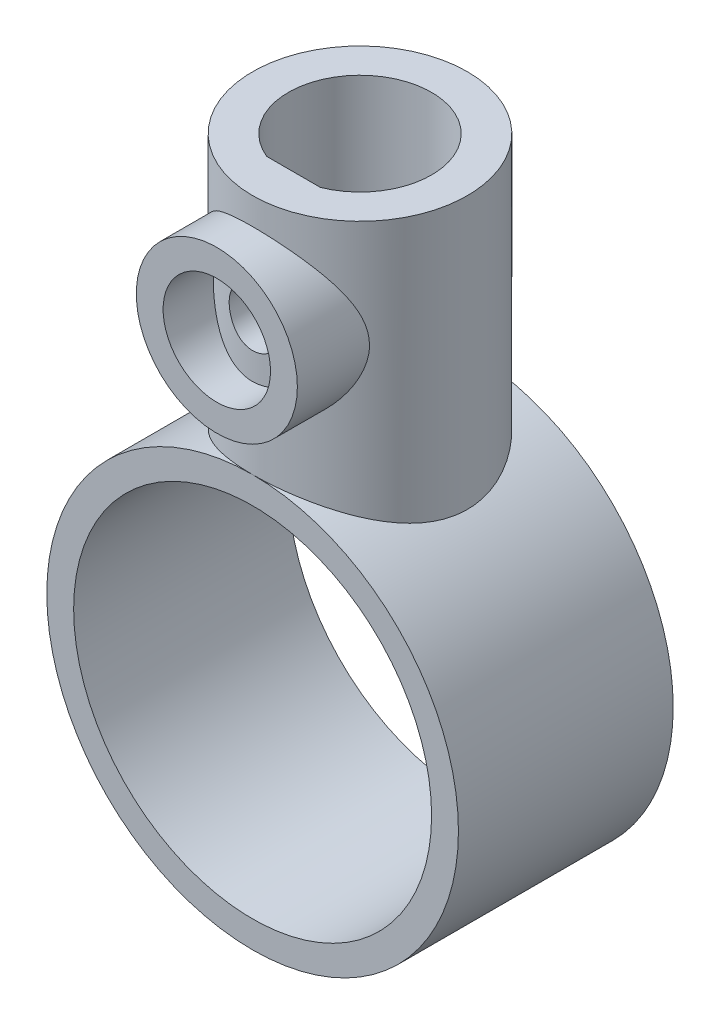
ISO-10303-21;
HEADER;
FILE_DESCRIPTION(('STEP AP214'),'2;1');
FILE_NAME('part.step','',(''),(''),'','','');
FILE_SCHEMA(('AUTOMOTIVE_DESIGN { 1 0 10303 214 1 1 1 1 }'));
ENDSEC;
DATA;
#1=APPLICATION_CONTEXT('core data for automotive mechanical design processes');
#2=APPLICATION_PROTOCOL_DEFINITION('international standard','automotive_design',2000,#1);
#3=PRODUCT_CONTEXT('',#1,'mechanical');
#4=PRODUCT('Part','Part','',(#3));
#5=PRODUCT_RELATED_PRODUCT_CATEGORY('part','',(#4));
#6=PRODUCT_DEFINITION_FORMATION('','',#4);
#7=PRODUCT_DEFINITION_CONTEXT('part definition',#1,'design');
#8=PRODUCT_DEFINITION('design','',#6,#7);
#9=PRODUCT_DEFINITION_SHAPE('','',#8);
#10=(LENGTH_UNIT() NAMED_UNIT(*) SI_UNIT(.MILLI.,.METRE.));
#11=(NAMED_UNIT(*) PLANE_ANGLE_UNIT() SI_UNIT($,.RADIAN.));
#12=(NAMED_UNIT(*) SI_UNIT($,.STERADIAN.) SOLID_ANGLE_UNIT());
#13=UNCERTAINTY_MEASURE_WITH_UNIT(LENGTH_MEASURE(1.E-05),#10,'distance_accuracy_value','');
#14=(GEOMETRIC_REPRESENTATION_CONTEXT(3) GLOBAL_UNCERTAINTY_ASSIGNED_CONTEXT((#13)) GLOBAL_UNIT_ASSIGNED_CONTEXT((#10,
#11,#12)) REPRESENTATION_CONTEXT('',''));
#15=CARTESIAN_POINT('',(0.,0.,0.));
#16=DIRECTION('',(0.,0.,1.));
#17=DIRECTION('',(1.,0.,0.));
#18=AXIS2_PLACEMENT_3D('',#15,#16,#17);
#19=CARTESIAN_POINT('',(-1.5,4.,3.70809924354783));
#20=DIRECTION('',(0.,0.,-1.));
#21=DIRECTION('',(-1.,0.,0.));
#22=AXIS2_PLACEMENT_3D('',#19,#20,#21);
#23=PLANE('',#22);
#24=CARTESIAN_POINT('',(0.,19.,3.70809924354783));
#25=DIRECTION('',(0.,0.,-1.));
#26=DIRECTION('',(-1.,0.,0.));
#27=AXIS2_PLACEMENT_3D('',#24,#25,#26);
#28=CIRCLE('',#27,1.5);
#29=CARTESIAN_POINT('',(-1.5,19.,3.70809924354783));
#30=VERTEX_POINT('',#29);
#31=CARTESIAN_POINT('',(1.5,19.,3.70809924354783));
#32=VERTEX_POINT('',#31);
#33=EDGE_CURVE('E11',#30,#32,#28,.T.);
#34=ORIENTED_EDGE('',*,*,#33,.F.);
#35=DIRECTION('',(0.,1.,0.));
#36=VECTOR('',#35,1.);
#37=CARTESIAN_POINT('',(-1.5,4.,3.70809924354783));
#38=LINE('',#37,#36);
#39=CARTESIAN_POINT('',(-1.5,25.,3.70809924354783));
#40=VERTEX_POINT('',#39);
#41=EDGE_CURVE('E61',#30,#40,#38,.T.);
#42=ORIENTED_EDGE('',*,*,#41,.T.);
#43=DIRECTION('',(-1.,0.,0.));
#44=VECTOR('',#43,1.);
#45=CARTESIAN_POINT('',(-1.5,25.,3.70809924354783));
#46=LINE('',#45,#44);
#47=CARTESIAN_POINT('',(1.5,25.,3.70809924354783));
#48=VERTEX_POINT('',#47);
#49=EDGE_CURVE('E105',#48,#40,#46,.T.);
#50=ORIENTED_EDGE('',*,*,#49,.F.);
#51=DIRECTION('',(0.,1.,0.));
#52=VECTOR('',#51,1.);
#53=CARTESIAN_POINT('',(1.5,4.,3.70809924354783));
#54=LINE('',#53,#52);
#55=EDGE_CURVE('E85',#32,#48,#54,.T.);
#56=ORIENTED_EDGE('',*,*,#55,.F.);
#57=EDGE_LOOP('',(#34,#42,#50,#56));
#58=FACE_BOUND('',#57,.T.);
#59=ADVANCED_FACE('F41',(#58),#23,.T.);
#60=CARTESIAN_POINT('',(0.,0.,6.));
#61=DIRECTION('',(0.,0.,1.));
#62=DIRECTION('',(1.,0.,0.));
#63=AXIS2_PLACEMENT_3D('',#60,#61,#62);
#64=PLANE('',#63);
#65=CARTESIAN_POINT('',(0.,0.,6.));
#66=DIRECTION('',(0.,0.,1.));
#67=DIRECTION('',(1.,0.,0.));
#68=AXIS2_PLACEMENT_3D('',#65,#66,#67);
#69=CIRCLE('',#68,11.5);
#70=CARTESIAN_POINT('',(0.,11.5,6.));
#71=VERTEX_POINT('',#70);
#72=EDGE_CURVE('E119',#71,#71,#69,.T.);
#73=ORIENTED_EDGE('',*,*,#72,.T.);
#74=EDGE_LOOP('',(#73));
#75=FACE_BOUND('',#74,.T.);
#76=CARTESIAN_POINT('',(0.,0.,6.));
#77=DIRECTION('',(0.,0.,1.));
#78=DIRECTION('',(1.,0.,0.));
#79=AXIS2_PLACEMENT_3D('',#76,#77,#78);
#80=CIRCLE('',#79,10.);
#81=CARTESIAN_POINT('',(10.,0.,6.));
#82=VERTEX_POINT('',#81);
#83=EDGE_CURVE('E192',#82,#82,#80,.T.);
#84=ORIENTED_EDGE('',*,*,#83,.F.);
#85=EDGE_LOOP('',(#84));
#86=FACE_BOUND('',#85,.T.);
#87=ADVANCED_FACE('F152',(#75,#86),#64,.T.);
#88=CARTESIAN_POINT('',(0.,0.,-6.));
#89=DIRECTION('',(0.,0.,1.));
#90=DIRECTION('',(1.,0.,0.));
#91=AXIS2_PLACEMENT_3D('',#88,#89,#90);
#92=PLANE('',#91);
#93=CARTESIAN_POINT('',(0.,0.,-6.));
#94=DIRECTION('',(0.,0.,1.));
#95=DIRECTION('',(1.,0.,0.));
#96=AXIS2_PLACEMENT_3D('',#93,#94,#95);
#97=CIRCLE('',#96,11.5);
#98=CARTESIAN_POINT('',(0.,11.5,-6.));
#99=VERTEX_POINT('',#98);
#100=EDGE_CURVE('E195',#99,#99,#97,.T.);
#101=ORIENTED_EDGE('',*,*,#100,.F.);
#102=EDGE_LOOP('',(#101));
#103=FACE_BOUND('',#102,.T.);
#104=CARTESIAN_POINT('',(0.,0.,-6.));
#105=DIRECTION('',(0.,0.,1.));
#106=DIRECTION('',(1.,0.,0.));
#107=AXIS2_PLACEMENT_3D('',#104,#105,#106);
#108=CIRCLE('',#107,10.);
#109=CARTESIAN_POINT('',(10.,0.,-6.));
#110=VERTEX_POINT('',#109);
#111=EDGE_CURVE('E196',#110,#110,#108,.T.);
#112=ORIENTED_EDGE('',*,*,#111,.T.);
#113=EDGE_LOOP('',(#112));
#114=FACE_BOUND('',#113,.T.);
#115=ADVANCED_FACE('F157',(#103,#114),#92,.F.);
#116=CARTESIAN_POINT('',(0.,0.,6.));
#117=DIRECTION('',(0.,0.,-1.));
#118=DIRECTION('',(-1.,0.,0.));
#119=AXIS2_PLACEMENT_3D('',#116,#117,#118);
#120=CYLINDRICAL_SURFACE('',#119,11.5);
#121=ORIENTED_EDGE('',*,*,#72,.F.);
#122=CARTESIAN_POINT('',(0.,11.5,6.));
#123=CARTESIAN_POINT('',(-0.156949578828013,11.5000001355779,6.00000018262044));
#124=CARTESIAN_POINT('',(-0.313897541694819,11.496779962264,5.99383515190377));
#125=CARTESIAN_POINT('',(-0.62662672321278,11.4839818639018,5.96925032429299));
#126=CARTESIAN_POINT('',(-0.782407480443761,11.4744015461444,5.95082591537107));
#127=CARTESIAN_POINT('',(-1.09175175440846,11.449113177051,5.90191753135049));
#128=CARTESIAN_POINT('',(-1.24531231034333,11.4333976079975,5.87141876050534));
#129=CARTESIAN_POINT('',(-1.54898348882052,11.3962303126682,5.79871024455503));
#130=CARTESIAN_POINT('',(-1.69909267420191,11.374776242212,5.75649571329124));
#131=CARTESIAN_POINT('',(-1.99416223199407,11.3267626640489,5.66102891920833));
#132=CARTESIAN_POINT('',(-2.1391425588515,11.3002263208967,5.60782665445636));
#133=CARTESIAN_POINT('',(-2.42383122801699,11.242605583116,5.49078903598036));
#134=CARTESIAN_POINT('',(-2.5635375574422,11.2115194736562,5.42694967181545));
#135=CARTESIAN_POINT('',(-2.97347192891134,11.1124815994392,5.22033899187204));
#136=CARTESIAN_POINT('',(-3.23482328090003,11.0386979829442,5.06237435139018));
#137=CARTESIAN_POINT('',(-3.74452958045324,10.8767973262684,4.69923611516626));
#138=CARTESIAN_POINT('',(-3.99097418237579,10.7880643171826,4.49168348355608));
#139=CARTESIAN_POINT('',(-4.44746391289365,10.6080279075606,4.04018397814692));
#140=CARTESIAN_POINT('',(-4.65747863814188,10.5167224332789,3.79620701855532));
#141=CARTESIAN_POINT('',(-4.9500372667915,10.3807564849467,3.39525217625011));
#142=CARTESIAN_POINT('',(-5.04702452632478,10.3338194266376,3.24936331256475));
#143=CARTESIAN_POINT('',(-5.22825678412562,10.243318226809,2.94891015824408));
#144=CARTESIAN_POINT('',(-5.3125071934178,10.1997526568336,2.79434959010944));
#145=CARTESIAN_POINT('',(-5.46751898205415,10.1175068939614,2.47737077950324));
#146=CARTESIAN_POINT('',(-5.53828138782106,10.0788263293965,2.31495313612708));
#147=CARTESIAN_POINT('',(-5.66549605291697,10.0078700406709,1.98334549078617));
#148=CARTESIAN_POINT('',(-5.72195711983363,9.97559037714005,1.81415973172985));
#149=CARTESIAN_POINT('',(-5.81683662761802,9.92054619063594,1.48073913098547));
#150=CARTESIAN_POINT('',(-5.85614780407481,9.89732024339665,1.3168349660179));
#151=CARTESIAN_POINT('',(-5.92092061333048,9.85870819120575,0.985481152489066));
#152=CARTESIAN_POINT('',(-5.94638992234961,9.84331774125874,0.818033522652497));
#153=CARTESIAN_POINT('',(-5.98307546018693,9.82106263754177,0.481141485903813));
#154=CARTESIAN_POINT('',(-5.99430220671729,9.81419169245375,0.311698645834845));
#155=CARTESIAN_POINT('',(-6.00233545828592,9.80928110826297,-0.0276480579803447));
#156=CARTESIAN_POINT('',(-5.99914357072103,9.81124048475129,-0.19755186822696));
#157=CARTESIAN_POINT('',(-5.97979128876469,9.82304398186207,-0.51352360962145));
#158=CARTESIAN_POINT('',(-5.96541862727512,9.8318008420255,-0.659746262263789));
#159=CARTESIAN_POINT('',(-5.92608183096438,9.85556101429154,-0.950290027245845));
#160=CARTESIAN_POINT('',(-5.90111441248935,9.87056626294253,-1.09461053574011));
#161=CARTESIAN_POINT('',(-5.84088654816273,9.90632463124334,-1.38034672465066));
#162=CARTESIAN_POINT('',(-5.80562691028427,9.92707729969522,-1.52176263215529));
#163=CARTESIAN_POINT('',(-5.72519555337458,9.97367980424171,-1.80090697735693));
#164=CARTESIAN_POINT('',(-5.68001991596398,9.99953165490471,-1.93863393312992));
#165=CARTESIAN_POINT('',(-5.5279839659833,10.0848968911938,-2.35127008986333));
#166=CARTESIAN_POINT('',(-5.40595529204078,10.1513811071148,-2.61932137568859));
#167=CARTESIAN_POINT('',(-5.12582570187863,10.2956624209485,-3.13233832170076));
#168=CARTESIAN_POINT('',(-4.96770863914093,10.3734645770196,-3.37729357882386));
#169=CARTESIAN_POINT('',(-4.59418299191638,10.5447319025564,-3.87335238223689));
#170=CARTESIAN_POINT('',(-4.37385657367154,10.6388667848999,-4.12053410943194));
#171=CARTESIAN_POINT('',(-3.89452386552147,10.8235162312259,-4.5762402813956));
#172=CARTESIAN_POINT('',(-3.63549598915202,10.9140287388104,-4.78474300580679));
#173=CARTESIAN_POINT('',(-3.21432111616678,11.0427084943075,-5.06942258731698));
#174=CARTESIAN_POINT('',(-3.06415302608552,11.0854180973587,-5.16160643824063));
#175=CARTESIAN_POINT('',(-2.75534105655066,11.1661770963876,-5.33284393580427));
#176=CARTESIAN_POINT('',(-2.59670081324254,11.2042284688993,-5.41190315646262));
#177=CARTESIAN_POINT('',(-2.27203832366379,11.274547726851,-5.55602186298455));
#178=CARTESIAN_POINT('',(-2.10601941978382,11.3068181982645,-5.62108761118108));
#179=CARTESIAN_POINT('',(-1.76778722899724,11.3646092392143,-5.73644830342684));
#180=CARTESIAN_POINT('',(-1.59557472936093,11.3901306632039,-5.78674511736463));
#181=CARTESIAN_POINT('',(-1.26171558673625,11.4317037739775,-5.86813103172292));
#182=CARTESIAN_POINT('',(-1.10046276945592,11.4483886224873,-5.90051563500229));
#183=CARTESIAN_POINT('',(-0.775301200908924,11.4749948435218,-5.9519739570192));
#184=CARTESIAN_POINT('',(-0.611392714773791,11.4849168870103,-5.9710489962542));
#185=CARTESIAN_POINT('',(-0.282358074725211,11.4977115427036,-5.99562178270494));
#186=CARTESIAN_POINT('',(-0.117232478147391,11.5005872021086,-6.00112539887258));
#187=CARTESIAN_POINT('',(0.212876139333156,11.4992139337846,-5.99849344051178));
#188=CARTESIAN_POINT('',(0.3778591672455,11.494965378924,-5.99035857979601));
#189=CARTESIAN_POINT('',(0.692077607348069,11.4801392838329,-5.96185612461983));
#190=CARTESIAN_POINT('',(0.84144333885876,11.4701395533605,-5.94260475543453));
#191=CARTESIAN_POINT('',(1.13788568955102,11.4445338372521,-5.89303027605832));
#192=CARTESIAN_POINT('',(1.28496157460335,11.4289260907783,-5.8627036883562));
#193=CARTESIAN_POINT('',(1.57576547001356,11.3924726565118,-5.791318826621));
#194=CARTESIAN_POINT('',(1.71949451694572,11.3716286147179,-5.7502639248081));
#195=CARTESIAN_POINT('',(2.00284565139829,11.3251593447799,-5.65781144649547));
#196=CARTESIAN_POINT('',(2.14246611448912,11.2995322541789,-5.6064098405095));
#197=CARTESIAN_POINT('',(2.42036025169913,11.2433297744297,-5.49226711627424));
#198=CARTESIAN_POINT('',(2.55850470284519,11.212643127812,-5.42926609647112));
#199=CARTESIAN_POINT('',(2.82894302130077,11.1474867251275,-5.29339248396463));
#200=CARTESIAN_POINT('',(2.96123488974968,11.1130156903428,-5.22051655263843));
#201=CARTESIAN_POINT('',(3.34837031438132,11.0050011672394,-4.98788532913089));
#202=CARTESIAN_POINT('',(3.59362293177135,10.9268248816615,-4.81406476637323));
#203=CARTESIAN_POINT('',(4.07845441766782,10.7558845893354,-4.41308062583474));
#204=CARTESIAN_POINT('',(4.31476155891882,10.6624498887889,-4.18224068751647));
#205=CARTESIAN_POINT('',(4.63865684293515,10.5236283447289,-3.80920784754676));
#206=CARTESIAN_POINT('',(4.74159614201419,10.4775407642409,-3.68029020728233));
#207=CARTESIAN_POINT('',(4.93679704899907,10.3869914671592,-3.41398249926734));
#208=CARTESIAN_POINT('',(5.0290569317233,10.342530014046,-3.2765910681174));
#209=CARTESIAN_POINT('',(5.20753347811362,10.2538835713497,-2.98538298472546));
#210=CARTESIAN_POINT('',(5.29304089939067,10.2098799999888,-2.83107557841413));
#211=CARTESIAN_POINT('',(5.45053097521652,10.1266797724421,-2.51454537611282));
#212=CARTESIAN_POINT('',(5.52252016002727,10.0874807984915,-2.35232644990204));
#213=CARTESIAN_POINT('',(5.65216403762049,10.0154153379937,-2.02105131937274));
#214=CARTESIAN_POINT('',(5.70983122240021,9.98254333857722,-1.85200122409344));
#215=CARTESIAN_POINT('',(5.81010867727672,9.92451532693214,-1.5082048281158));
#216=CARTESIAN_POINT('',(5.85272151536934,9.89935799881863,-1.33345950447927));
#217=CARTESIAN_POINT('',(5.91879845654421,9.85997735719745,-0.997125596417494));
#218=CARTESIAN_POINT('',(5.94372747316169,9.84492546066004,-0.835921212389536));
#219=CARTESIAN_POINT('',(5.98038742493022,9.8226998129173,-0.511477725647173));
#220=CARTESIAN_POINT('',(5.99211929476957,9.81552550378247,-0.348238767859586));
#221=CARTESIAN_POINT('',(6.00219018121765,9.80937042445035,-0.0212746956513033));
#222=CARTESIAN_POINT('',(6.00053582448518,9.8103856001657,0.142450138120793));
#223=CARTESIAN_POINT('',(5.98387835527525,9.8205546927914,0.468955429442394));
#224=CARTESIAN_POINT('',(5.96887599193866,9.82970815295026,0.63173593947489));
#225=CARTESIAN_POINT('',(5.9281912772814,9.85429043436739,0.936742751821819));
#226=CARTESIAN_POINT('',(5.90389851592597,9.8688984859434,1.07922324730548));
#227=CARTESIAN_POINT('',(5.84528177464224,9.90372810988935,1.36142472318204));
#228=CARTESIAN_POINT('',(5.81095451103376,9.92395151971456,1.5011447842494));
#229=CARTESIAN_POINT('',(5.6934422344186,9.99214740783945,1.91488554677635));
#230=CARTESIAN_POINT('',(5.59570137647594,10.0476618132275,2.18367293189669));
#231=CARTESIAN_POINT('',(5.35717564237034,10.1769405832222,2.71886242225505));
#232=CARTESIAN_POINT('',(5.21397923406321,10.2516663146063,2.98394079537056));
#233=CARTESIAN_POINT('',(4.8911095660573,10.4095819630624,3.48808983239893));
#234=CARTESIAN_POINT('',(4.71141672357171,10.4927764121656,3.72714642766466));
#235=CARTESIAN_POINT('',(4.29183181980602,10.6718711921826,4.2065242224796));
#236=CARTESIAN_POINT('',(4.04707182811809,10.7679568339543,4.4425706468183));
#237=CARTESIAN_POINT('',(3.6514874658084,10.9057916851509,4.76399275734891));
#238=CARTESIAN_POINT('',(3.5147550364512,10.9507237321279,4.86576586077563));
#239=CARTESIAN_POINT('',(3.2324366198641,11.0373504171677,5.05771159354309));
#240=CARTESIAN_POINT('',(3.08685463531811,11.0790464997228,5.14788941081377));
#241=CARTESIAN_POINT('',(2.78486276212108,11.1588253208791,5.31743165196371));
#242=CARTESIAN_POINT('',(2.62830336717773,11.1968278691941,5.39656770964361));
#243=CARTESIAN_POINT('',(2.30786598455685,11.2672374830238,5.54117575722826));
#244=CARTESIAN_POINT('',(2.14399164949463,11.2996473027075,5.60665447609682));
#245=CARTESIAN_POINT('',(1.81040554038438,11.3578623353638,5.72307380861668));
#246=CARTESIAN_POINT('',(1.64070671649353,11.3836812442014,5.77404459543316));
#247=CARTESIAN_POINT('',(1.29664056140088,11.4279822417378,5.86090237441121));
#248=CARTESIAN_POINT('',(1.12227597512955,11.4464685472303,5.89679803659391));
#249=CARTESIAN_POINT('',(0.79028551012741,11.4738827208415,5.94982642127283));
#250=CARTESIAN_POINT('',(0.632992460182276,11.483654127812,5.96861998891456));
#251=CARTESIAN_POINT('',(0.31713240879531,11.4967127694845,5.99370682209347));
#252=CARTESIAN_POINT('',(0.158565379695044,11.4999998630263,5.99999981549947));
#253=CARTESIAN_POINT('',(0.,11.5,6.));
#254=B_SPLINE_CURVE_WITH_KNOTS('',3,(#122,#123,#124,#125,#126,#127,#128,#129,#130,#131,#132,
#133,#134,#135,#136,#137,#138,#139,#140,#141,#142,#143,#144,#145,#146,#147,#148,#149,#150,#151,
#152,#153,#154,#155,#156,#157,#158,#159,#160,#161,#162,#163,#164,#165,#166,#167,#168,#169,#170,
#171,#172,#173,#174,#175,#176,#177,#178,#179,#180,#181,#182,#183,#184,#185,#186,#187,#188,#189,
#190,#191,#192,#193,#194,#195,#196,#197,#198,#199,#200,#201,#202,#203,#204,#205,#206,#207,#208,
#209,#210,#211,#212,#213,#214,#215,#216,#217,#218,#219,#220,#221,#222,#223,#224,#225,#226,#227,
#228,#229,#230,#231,#232,#233,#234,#235,#236,#237,#238,#239,#240,#241,#242,#243,#244,#245,#246,
#247,#248,#249,#250,#251,#252,#253),.UNSPECIFIED.,.T.,.F.,(4,2,2,2,2,2,2,2,2,2,2,2,2,2,2,2,2,2,
2,2,2,2,2,2,2,2,2,2,2,2,2,2,2,2,2,2,2,2,2,2,2,2,2,2,2,2,2,2,2,2,2,2,2,2,2,2,2,2,2,2,2,2,2,2,2,
4),(0.,0.470692988347527,0.941563153500217,1.41301211091961,1.88465395034882,2.35419515677509,
2.82391379370479,3.76237773296836,4.76106646584416,5.76058470750014,6.30410876981105,
6.84740127274561,7.39065241517702,7.93356817434236,8.4432575664312,8.95266401326091,
9.46169405906647,9.97066735933802,10.4117092732762,10.8528879801556,11.2940320623631,
11.7353507807,12.6372965018234,13.5396465616096,14.5680573329444,15.597043875982,
16.140352845317,16.6834304782373,17.2262645659939,17.7690298960917,18.2643078023531,
18.7595365630343,19.2545511248155,19.749539779258,20.2018125668466,20.6542274859734,
21.1065003686736,21.5589497293685,22.0231534673376,22.4875145420254,23.4157482798121,
24.4409922351983,24.9544170464423,25.4679246823015,26.0126762775516,26.557164038545,
27.1011752028527,27.6450935239605,28.1358290947884,28.6265299070667,29.1169878198374,
29.6074182079819,30.0427373760832,30.4781991573565,31.3485636603898,32.2762679094131,
33.2044712553565,34.2592761503955,34.7875907669549,35.3156681778426,35.8534199346152,
36.3909061122234,36.92726613486,37.4633172617339,37.9388456973503,38.4143844848669),.UNSPECIFIED.);
#255=EDGE_CURVE('E191',#71,#99,#254,.T.);
#256=ORIENTED_EDGE('',*,*,#255,.T.);
#257=ORIENTED_EDGE('',*,*,#100,.T.);
#258=EDGE_CURVE('E185',#99,#71,#254,.T.);
#259=ORIENTED_EDGE('',*,*,#258,.T.);
#260=EDGE_LOOP('',(#121,#256,#257,#259));
#261=FACE_BOUND('',#260,.T.);
#262=ADVANCED_FACE('F43',(#261),#120,.T.);
#263=CARTESIAN_POINT('',(0.,0.,6.));
#264=DIRECTION('',(0.,0.,-1.));
#265=DIRECTION('',(-1.,0.,0.));
#266=AXIS2_PLACEMENT_3D('',#263,#264,#265);
#267=CYLINDRICAL_SURFACE('',#266,10.);
#268=ORIENTED_EDGE('',*,*,#111,.F.);
#269=EDGE_LOOP('',(#268));
#270=FACE_BOUND('',#269,.T.);
#271=ORIENTED_EDGE('',*,*,#83,.T.);
#272=EDGE_LOOP('',(#271));
#273=FACE_BOUND('',#272,.T.);
#274=ADVANCED_FACE('F147',(#270,#273),#267,.F.);
#275=CARTESIAN_POINT('',(0.,7.,0.));
#276=DIRECTION('',(0.,1.,0.));
#277=DIRECTION('',(0.,0.,1.));
#278=AXIS2_PLACEMENT_3D('',#275,#276,#277);
#279=CYLINDRICAL_SURFACE('',#278,6.);
#280=CARTESIAN_POINT('',(0.,14.5,6.));
#281=CARTESIAN_POINT('',(0.109889093347408,14.5000011294671,5.99999891458961));
#282=CARTESIAN_POINT('',(0.219805941175627,14.5040327909765,5.99697354418681));
#283=CARTESIAN_POINT('',(0.438770398435287,14.5200952614837,5.98494104489408));
#284=CARTESIAN_POINT('',(0.547817448208755,14.5321308568972,5.97593033672866));
#285=CARTESIAN_POINT('',(0.764337145433688,14.5640356789986,5.95211436344858));
#286=CARTESIAN_POINT('',(0.871806385633666,14.5839198331226,5.93729805686586));
#287=CARTESIAN_POINT('',(1.08418805697161,14.6312019229553,5.90221569010817));
#288=CARTESIAN_POINT('',(1.18909932404113,14.6586032125078,5.88194719746554));
#289=CARTESIAN_POINT('',(1.49757938789377,14.7511135185901,5.81388560512759));
#290=CARTESIAN_POINT('',(1.69647043659264,14.8267689992563,5.75865356416133));
#291=CARTESIAN_POINT('',(2.0773014061239,15.0026345718088,5.63251169691292));
#292=CARTESIAN_POINT('',(2.25924626428775,15.1028374806345,5.56160645750905));
#293=CARTESIAN_POINT('',(2.62038343530416,15.3347836175825,5.40149143720216));
#294=CARTESIAN_POINT('',(2.7977605807614,15.4685883161648,5.3111946301346));
#295=CARTESIAN_POINT('',(3.12910063986217,15.7585012052278,5.12299513886082));
#296=CARTESIAN_POINT('',(3.28302663282824,15.9146438295689,5.02508082059738));
#297=CARTESIAN_POINT('',(3.50989795897319,16.1808030938789,4.86738358236192));
#298=CARTESIAN_POINT('',(3.59069180626067,16.2844455848838,4.80793371046208));
#299=CARTESIAN_POINT('',(3.74322544654586,16.4988832798417,4.69015334571095));
#300=CARTESIAN_POINT('',(3.81496250933513,16.6096806255159,4.63182319487671));
#301=CARTESIAN_POINT('',(3.94893156983772,16.8381826497333,4.51814668128919));
#302=CARTESIAN_POINT('',(4.01117306801042,16.9558802590167,4.46279737251987));
#303=CARTESIAN_POINT('',(4.1256676234243,17.1981057595547,4.35716994993288));
#304=CARTESIAN_POINT('',(4.17792636716668,17.32262970996,4.30688895679481));
#305=CARTESIAN_POINT('',(4.28640525768316,17.6184721251543,4.19931574250485));
#306=CARTESIAN_POINT('',(4.33878225483385,17.7922774101787,4.14472379535654));
#307=CARTESIAN_POINT('',(4.40170048354313,18.0600818346746,4.0774962339577));
#308=CARTESIAN_POINT('',(4.42005938187711,18.1504796120566,4.05753758966772));
#309=CARTESIAN_POINT('',(4.4512949205472,18.3332510009736,4.02324658314216));
#310=CARTESIAN_POINT('',(4.46417438609748,18.425623568433,4.00891132176916));
#311=CARTESIAN_POINT('',(4.48429174655721,18.6126308036267,3.98639692409778));
#312=CARTESIAN_POINT('',(4.49147508503209,18.7072786072793,3.97827734538491));
#313=CARTESIAN_POINT('',(4.49982888727541,18.8971801462592,3.96882608226025));
#314=CARTESIAN_POINT('',(4.50099951602798,18.9924338648888,3.96749421159899));
#315=CARTESIAN_POINT('',(4.49729624749168,19.1827042275204,3.97169172606449));
#316=CARTESIAN_POINT('',(4.49242037192344,19.2777207837346,3.97722335677388));
#317=CARTESIAN_POINT('',(4.47674629668977,19.4666240765153,3.99485600062064));
#318=CARTESIAN_POINT('',(4.4659480366857,19.5605108015608,4.00695708068908));
#319=CARTESIAN_POINT('',(4.42793178607206,19.8194498130473,4.0490459732948));
#320=CARTESIAN_POINT('',(4.39447810806165,19.9825633444955,4.08561863083273));
#321=CARTESIAN_POINT('',(4.31116661359801,20.3003624488837,4.17342186253744));
#322=CARTESIAN_POINT('',(4.26129303011848,20.4550397539704,4.22466651913371));
#323=CARTESIAN_POINT('',(4.15750427603693,20.7269017032238,4.32659493027418));
#324=CARTESIAN_POINT('',(4.10608094174934,20.845695699598,4.37559813141502));
#325=CARTESIAN_POINT('',(3.9940957317505,21.0769485445692,4.47805297194817));
#326=CARTESIAN_POINT('',(3.93352916932107,21.1894041033167,4.53150688638884));
#327=CARTESIAN_POINT('',(3.80359911294738,21.4080784699169,4.64110702588745));
#328=CARTESIAN_POINT('',(3.73421761853561,21.5142838463492,4.69725860953782));
#329=CARTESIAN_POINT('',(3.58706739244453,21.7201011020785,4.8105689966731));
#330=CARTESIAN_POINT('',(3.50929997577336,21.8197140112074,4.86772764106675));
#331=CARTESIAN_POINT('',(3.34349359023795,22.014600856287,4.98312136806285));
#332=CARTESIAN_POINT('',(3.25524580981755,22.1097031417741,5.04134746160555));
#333=CARTESIAN_POINT('',(3.07029468707218,22.2924478590235,5.15608052037839));
#334=CARTESIAN_POINT('',(2.97358801427109,22.3800873254433,5.21258679656341));
#335=CARTESIAN_POINT('',(2.6713951627135,22.6306978644993,5.37736520094061));
#336=CARTESIAN_POINT('',(2.45334193673714,22.7819456312961,5.48125501706315));
#337=CARTESIAN_POINT('',(2.03364486448049,23.0199696824772,5.64841211291028));
#338=CARTESIAN_POINT('',(1.83748027153195,23.1135924910684,5.71564776265942));
#339=CARTESIAN_POINT('',(1.53111760132374,23.2329332471858,5.80232606549604));
#340=CARTESIAN_POINT('',(1.42694873352602,23.2692046133877,5.82886136254735));
#341=CARTESIAN_POINT('',(1.21514078323795,23.3342460314602,5.87666566536364));
#342=CARTESIAN_POINT('',(1.10750322026002,23.3630193191002,5.89793694259762));
#343=CARTESIAN_POINT('',(0.88871781769923,23.4128055509489,5.93486078841916));
#344=CARTESIAN_POINT('',(0.777551290241449,23.4337652057892,5.95047475430196));
#345=CARTESIAN_POINT('',(0.553314664518955,23.467290676268,5.97549672880646));
#346=CARTESIAN_POINT('',(0.440245456027404,23.4798603094133,5.98490755986495));
#347=CARTESIAN_POINT('',(0.213138112774598,23.4963911307008,5.99729131677819));
#348=CARTESIAN_POINT('',(0.0991000807339415,23.5003532203088,6.00026491680243));
#349=CARTESIAN_POINT('',(-0.128924004164648,23.4995973647597,5.99969802204365));
#350=CARTESIAN_POINT('',(-0.242910060410479,23.4948801035779,5.99615804056264));
#351=CARTESIAN_POINT('',(-0.458359309321768,23.4777646169937,5.98333914716503));
#352=CARTESIAN_POINT('',(-0.559925654784926,23.4661893718466,5.97467529241264));
#353=CARTESIAN_POINT('',(-0.761509471832513,23.4362714798985,5.95234483916794));
#354=CARTESIAN_POINT('',(-0.861526443144634,23.417926692879,5.93867665854811));
#355=CARTESIAN_POINT('',(-1.15822112079917,23.3530912401756,5.89054640165166));
#356=CARTESIAN_POINT('',(-1.35171086589156,23.2967856018695,5.84894797975807));
#357=CARTESIAN_POINT('',(-1.73228134926415,23.1583340632544,5.74799326968347));
#358=CARTESIAN_POINT('',(-1.91889489081806,23.0753463235938,5.6880620726575));
#359=CARTESIAN_POINT('',(-2.27554820689944,22.8874827658653,5.55500899832897));
#360=CARTESIAN_POINT('',(-2.44558568382775,22.7826039197937,5.4818852964136));
#361=CARTESIAN_POINT('',(-2.79453310532872,22.5346535485432,5.3135789667053));
#362=CARTESIAN_POINT('',(-2.97018255829928,22.38812881087,5.21675184612658));
#363=CARTESIAN_POINT('',(-3.29617701529982,22.0719592806394,5.01714954819793));
#364=CARTESIAN_POINT('',(-3.44646429081067,21.9022632921301,4.91436149812868));
#365=CARTESIAN_POINT('',(-3.66485279148531,21.6147632848622,4.75175914800945));
#366=CARTESIAN_POINT('',(-3.74160688158693,21.503737592175,4.69138155023432));
#367=CARTESIAN_POINT('',(-3.88538288286795,21.2742355283931,4.57301411996174));
#368=CARTESIAN_POINT('',(-3.95240121830691,21.1557564426018,4.51502517033926));
#369=CARTESIAN_POINT('',(-4.07601132979723,20.9117479666978,4.4037523230846));
#370=CARTESIAN_POINT('',(-4.13262761463078,20.7862360825667,4.35045752383189));
#371=CARTESIAN_POINT('',(-4.23483799347876,20.5282049371906,4.25102602893999));
#372=CARTESIAN_POINT('',(-4.28044122552356,20.3956915974288,4.20488341027822));
#373=CARTESIAN_POINT('',(-4.36845672106764,20.0937875003623,4.11357442921736));
#374=CARTESIAN_POINT('',(-4.4079315685515,19.9227234788207,4.07088196064296));
#375=CARTESIAN_POINT('',(-4.45207472373049,19.6609682991833,4.02237420162758));
#376=CARTESIAN_POINT('',(-4.46427504711804,19.572905929485,4.00879660432936));
#377=CARTESIAN_POINT('',(-4.4834680758767,19.3955428394604,3.98732076667201));
#378=CARTESIAN_POINT('',(-4.49046310023616,19.3062426886557,3.97941999731001));
#379=CARTESIAN_POINT('',(-4.49912377275457,19.1265714882172,3.96962572250055));
#380=CARTESIAN_POINT('',(-4.5007605350049,19.0361972616554,3.96776477766403));
#381=CARTESIAN_POINT('',(-4.49858902178251,18.8556012837386,3.97022662849373));
#382=CARTESIAN_POINT('',(-4.49478086073992,18.7653795292192,3.97454929420562));
#383=CARTESIAN_POINT('',(-4.48179686837458,18.5857350557672,3.98918426930135));
#384=CARTESIAN_POINT('',(-4.47261609100104,18.4963131502948,3.99950209779238));
#385=CARTESIAN_POINT('',(-4.44906488337301,18.3189469634802,4.02568379399863));
#386=CARTESIAN_POINT('',(-4.43469176716216,18.2310034715958,4.04155053198557));
#387=CARTESIAN_POINT('',(-4.39733349376684,18.0381874988729,4.08220219052988));
#388=CARTESIAN_POINT('',(-4.37315486259243,17.9337958939218,4.10817647046758));
#389=CARTESIAN_POINT('',(-4.31794967657223,17.7285339167726,4.16616349724296));
#390=CARTESIAN_POINT('',(-4.2869179534403,17.6276662690312,4.19818079878609));
#391=CARTESIAN_POINT('',(-4.18412323706428,17.3305448372768,4.30145231932211));
#392=CARTESIAN_POINT('',(-4.1027109091687,17.1400225963753,4.3798678069886));
#393=CARTESIAN_POINT('',(-3.9474249106568,16.835088347444,4.51939722595005));
#394=CARTESIAN_POINT('',(-3.87974782066622,16.71611446485,4.57781629006054));
#395=CARTESIAN_POINT('',(-3.73446396256384,16.4855755293171,4.69708419013885));
#396=CARTESIAN_POINT('',(-3.65685410051125,16.374012801383,4.75793377910643));
#397=CARTESIAN_POINT('',(-3.49199896371192,16.1584557734138,4.88021437732419));
#398=CARTESIAN_POINT('',(-3.4047464734812,16.0544672389323,4.94164579008862));
#399=CARTESIAN_POINT('',(-3.22086724321516,15.8544538025505,5.06341507322312));
#400=CARTESIAN_POINT('',(-3.12424164245583,15.7584279354349,5.12375307543882));
#401=CARTESIAN_POINT('',(-2.92094051992678,15.5740557415067,5.24233459605185));
#402=CARTESIAN_POINT('',(-2.81418733992435,15.4857807610639,5.30055624238108));
#403=CARTESIAN_POINT('',(-2.59155834817433,15.3185320893711,5.41288921441326));
#404=CARTESIAN_POINT('',(-2.47568134695061,15.2395596142533,5.46700000236916));
#405=CARTESIAN_POINT('',(-2.2354585667899,15.0919880783076,5.56953753341985));
#406=CARTESIAN_POINT('',(-2.11112950456185,15.0233693583386,5.61797500852091));
#407=CARTESIAN_POINT('',(-1.85449942812324,14.8974111748911,5.70782682591745));
#408=CARTESIAN_POINT('',(-1.72220257447269,14.8400658903128,5.74924479124345));
#409=CARTESIAN_POINT('',(-1.49047443441803,14.7527641454616,5.81277915717968));
#410=CARTESIAN_POINT('',(-1.39277403449767,14.7197062050498,5.83699489752918));
#411=CARTESIAN_POINT('',(-1.19438520737669,14.6601657761295,5.88079529778919));
#412=CARTESIAN_POINT('',(-1.09369751240767,14.6336816909346,5.90038108218822));
#413=CARTESIAN_POINT('',(-0.890153036732819,14.5876887424056,5.93449690992767));
#414=CARTESIAN_POINT('',(-0.78730186317353,14.5681637535663,5.94903863914562));
#415=CARTESIAN_POINT('',(-0.579924242576492,14.5362928237634,5.97281913493785));
#416=CARTESIAN_POINT('',(-0.475398680414266,14.5239432115473,5.98206061333278));
#417=CARTESIAN_POINT('',(-0.308901540250481,14.5101899212115,5.99236050942498));
#418=CARTESIAN_POINT('',(-0.247226964473496,14.5063713154458,5.9952227508103));
#419=CARTESIAN_POINT('',(-0.123704541394463,14.5012758323691,5.99904295486112));
#420=CARTESIAN_POINT('',(-0.0618566678036201,14.499999364222,6.00000061097847));
#421=CARTESIAN_POINT('',(0.,14.5,6.));
#422=B_SPLINE_CURVE_WITH_KNOTS('',3,(#280,#281,#282,#283,#284,#285,#286,#287,#288,#289,#290,
#291,#292,#293,#294,#295,#296,#297,#298,#299,#300,#301,#302,#303,#304,#305,#306,#307,#308,#309,
#310,#311,#312,#313,#314,#315,#316,#317,#318,#319,#320,#321,#322,#323,#324,#325,#326,#327,#328,
#329,#330,#331,#332,#333,#334,#335,#336,#337,#338,#339,#340,#341,#342,#343,#344,#345,#346,#347,
#348,#349,#350,#351,#352,#353,#354,#355,#356,#357,#358,#359,#360,#361,#362,#363,#364,#365,#366,
#367,#368,#369,#370,#371,#372,#373,#374,#375,#376,#377,#378,#379,#380,#381,#382,#383,#384,#385,
#386,#387,#388,#389,#390,#391,#392,#393,#394,#395,#396,#397,#398,#399,#400,#401,#402,#403,#404,
#405,#406,#407,#408,#409,#410,#411,#412,#413,#414,#415,#416,#417,#418,#419,#420,#421),
.UNSPECIFIED.,.T.,.F.,(4,2,2,2,2,2,2,2,2,2,2,2,2,2,2,2,2,2,2,2,2,2,2,2,2,2,2,2,2,2,2,2,2,2,2,2,
2,2,2,2,2,2,2,2,2,2,2,2,2,2,2,2,2,2,2,2,2,2,2,2,2,2,2,2,2,2,2,2,2,2,4),(0.,0.329600286287096,
0.659397853603486,0.989825719960074,1.32040125039071,1.97680129284112,2.63300948866885,
3.34998523164386,4.06807834427585,4.50038257614144,4.93281681845946,5.36481552540727,
5.79656741322034,6.36290574742223,6.64575524232191,6.92845872179299,7.21383823687262,
7.49920992131667,7.78467499755541,8.07014298223252,8.5795098581075,9.08936728124543,
9.50406055709009,9.91896712648401,10.3347349965674,10.7504377640618,11.1765740081604,
11.6028787944853,12.452982151112,13.1325974264929,13.472582027686,13.8124196658375,
14.1545343594503,14.4964932826519,14.8384163908541,15.1803125550005,15.4877135575457,
15.7952118295641,16.4097070247786,17.0458894037147,17.6821598385305,18.4246876816604,
19.1688834887679,19.6120265779791,20.0553320151668,20.497579175253,20.9394581121787,
21.4790850793635,21.7486060265023,22.0180068286248,22.2888575752023,22.5597026296827,
22.8307974182615,23.1020326433395,23.432295269032,23.7628078193325,24.4246082447263,
24.870632578431,25.3167961831134,25.7632959375952,26.2097414890913,26.6599401926676,
27.1101976863158,27.5595891961842,28.0087480472674,28.3262737413028,28.6437222376958,
28.9604302906449,29.2769761581783,29.4624785960412,29.648010888608),.UNSPECIFIED.);
#423=CARTESIAN_POINT('',(0.,14.5,6.));
#424=VERTEX_POINT('',#423);
#425=EDGE_CURVE('E111',#424,#424,#422,.T.);
#426=ORIENTED_EDGE('',*,*,#425,.F.);
#427=EDGE_LOOP('',(#426));
#428=FACE_BOUND('',#427,.T.);
#429=CARTESIAN_POINT('',(0.,25.,0.));
#430=DIRECTION('',(0.,1.,0.));
#431=DIRECTION('',(0.,0.,1.));
#432=AXIS2_PLACEMENT_3D('',#429,#430,#431);
#433=CIRCLE('',#432,6.);
#434=CARTESIAN_POINT('',(0.,25.,6.));
#435=VERTEX_POINT('',#434);
#436=EDGE_CURVE('E181',#435,#435,#433,.T.);
#437=ORIENTED_EDGE('',*,*,#436,.F.);
#438=EDGE_LOOP('',(#437));
#439=FACE_BOUND('',#438,.T.);
#440=ORIENTED_EDGE('',*,*,#255,.F.);
#441=ORIENTED_EDGE('',*,*,#258,.F.);
#442=EDGE_LOOP('',(#440,#441));
#443=FACE_BOUND('',#442,.T.);
#444=ADVANCED_FACE('F125',(#428,#439,#443),#279,.T.);
#445=CARTESIAN_POINT('',(0.,25.,0.));
#446=DIRECTION('',(0.,1.,0.));
#447=DIRECTION('',(0.,0.,1.));
#448=AXIS2_PLACEMENT_3D('',#445,#446,#447);
#449=PLANE('',#448);
#450=CARTESIAN_POINT('',(0.,25.,0.));
#451=DIRECTION('',(0.,1.,0.));
#452=DIRECTION('',(0.,0.,1.));
#453=AXIS2_PLACEMENT_3D('',#450,#451,#452);
#454=CIRCLE('',#453,4.);
#455=EDGE_CURVE('E94',#48,#40,#454,.T.);
#456=ORIENTED_EDGE('',*,*,#455,.F.);
#457=ORIENTED_EDGE('',*,*,#49,.T.);
#458=EDGE_LOOP('',(#456,#457));
#459=FACE_BOUND('',#458,.T.);
#460=ORIENTED_EDGE('',*,*,#436,.T.);
#461=EDGE_LOOP('',(#460));
#462=FACE_BOUND('',#461,.T.);
#463=ADVANCED_FACE('F141',(#459,#462),#449,.T.);
#464=CARTESIAN_POINT('',(0.,15.,0.));
#465=DIRECTION('',(0.,1.,0.));
#466=DIRECTION('',(0.,0.,1.));
#467=AXIS2_PLACEMENT_3D('',#464,#465,#466);
#468=CYLINDRICAL_SURFACE('',#467,4.);
#469=ORIENTED_EDGE('',*,*,#455,.T.);
#470=ORIENTED_EDGE('',*,*,#41,.F.);
#471=CARTESIAN_POINT('',(-1.5,15.,3.70809924354783));
#472=VERTEX_POINT('',#471);
#473=EDGE_CURVE('E91',#472,#30,#38,.T.);
#474=ORIENTED_EDGE('',*,*,#473,.F.);
#475=CARTESIAN_POINT('',(0.,15.,0.));
#476=DIRECTION('',(0.,1.,0.));
#477=DIRECTION('',(0.,0.,1.));
#478=AXIS2_PLACEMENT_3D('',#475,#476,#477);
#479=CIRCLE('',#478,4.);
#480=CARTESIAN_POINT('',(1.5,15.,3.70809924354783));
#481=VERTEX_POINT('',#480);
#482=EDGE_CURVE('E179',#481,#472,#479,.T.);
#483=ORIENTED_EDGE('',*,*,#482,.F.);
#484=EDGE_CURVE('E96',#481,#32,#54,.T.);
#485=ORIENTED_EDGE('',*,*,#484,.T.);
#486=ORIENTED_EDGE('',*,*,#55,.T.);
#487=EDGE_LOOP('',(#469,#470,#474,#483,#485,#486));
#488=FACE_BOUND('',#487,.T.);
#489=ADVANCED_FACE('F89',(#488),#468,.F.);
#490=CARTESIAN_POINT('',(0.,15.,0.));
#491=DIRECTION('',(0.,1.,0.));
#492=DIRECTION('',(0.,0.,1.));
#493=AXIS2_PLACEMENT_3D('',#490,#491,#492);
#494=PLANE('',#493);
#495=DIRECTION('',(-1.,0.,0.));
#496=VECTOR('',#495,1.);
#497=CARTESIAN_POINT('',(0.,15.,3.70809924354783));
#498=LINE('',#497,#496);
#499=EDGE_CURVE('E84',#481,#472,#498,.T.);
#500=ORIENTED_EDGE('',*,*,#499,.F.);
#501=ORIENTED_EDGE('',*,*,#482,.T.);
#502=EDGE_LOOP('',(#500,#501));
#503=FACE_BOUND('',#502,.T.);
#504=ADVANCED_FACE('F135',(#503),#494,.T.);
#505=CARTESIAN_POINT('',(0.,19.,3.));
#506=DIRECTION('',(0.,0.,1.));
#507=DIRECTION('',(1.,0.,0.));
#508=AXIS2_PLACEMENT_3D('',#505,#506,#507);
#509=CYLINDRICAL_SURFACE('',#508,4.5);
#510=ORIENTED_EDGE('',*,*,#425,.T.);
#511=EDGE_LOOP('',(#510));
#512=FACE_BOUND('',#511,.T.);
#513=CARTESIAN_POINT('',(0.,19.,8.));
#514=DIRECTION('',(0.,0.,1.));
#515=DIRECTION('',(1.,0.,0.));
#516=AXIS2_PLACEMENT_3D('',#513,#514,#515);
#517=CIRCLE('',#516,4.5);
#518=CARTESIAN_POINT('',(4.5,19.,8.));
#519=VERTEX_POINT('',#518);
#520=EDGE_CURVE('E101',#519,#519,#517,.T.);
#521=ORIENTED_EDGE('',*,*,#520,.F.);
#522=EDGE_LOOP('',(#521));
#523=FACE_BOUND('',#522,.T.);
#524=ADVANCED_FACE('F129',(#512,#523),#509,.T.);
#525=CARTESIAN_POINT('',(0.,19.,8.));
#526=DIRECTION('',(0.,0.,1.));
#527=DIRECTION('',(1.,0.,0.));
#528=AXIS2_PLACEMENT_3D('',#525,#526,#527);
#529=PLANE('',#528);
#530=CARTESIAN_POINT('',(0.,19.,8.));
#531=DIRECTION('',(0.,0.,1.));
#532=DIRECTION('',(1.,0.,0.));
#533=AXIS2_PLACEMENT_3D('',#530,#531,#532);
#534=CIRCLE('',#533,3.);
#535=CARTESIAN_POINT('',(3.,19.,8.));
#536=VERTEX_POINT('',#535);
#537=EDGE_CURVE('E99',#536,#536,#534,.T.);
#538=ORIENTED_EDGE('',*,*,#537,.F.);
#539=EDGE_LOOP('',(#538));
#540=FACE_BOUND('',#539,.T.);
#541=ORIENTED_EDGE('',*,*,#520,.T.);
#542=EDGE_LOOP('',(#541));
#543=FACE_BOUND('',#542,.T.);
#544=ADVANCED_FACE('F134',(#540,#543),#529,.T.);
#545=CARTESIAN_POINT('',(0.,19.,3.));
#546=DIRECTION('',(0.,0.,1.));
#547=DIRECTION('',(1.,0.,0.));
#548=AXIS2_PLACEMENT_3D('',#545,#546,#547);
#549=CYLINDRICAL_SURFACE('',#548,3.);
#550=CARTESIAN_POINT('',(0.,16.,6.));
#551=CARTESIAN_POINT('',(0.0788941476270899,16.0000008387405,5.99999934964153));
#552=CARTESIAN_POINT('',(0.15779662040795,16.0031179454755,5.99843869002385));
#553=CARTESIAN_POINT('',(0.315001991255922,16.01553927174,5.99224358793258));
#554=CARTESIAN_POINT('',(0.393304603620535,16.0248462740654,5.98760776295702));
#555=CARTESIAN_POINT('',(0.626628691373742,16.0619578568186,5.96921978027472));
#556=CARTESIAN_POINT('',(0.779952894844981,16.0989528290627,5.95098734455496));
#557=CARTESIAN_POINT('',(1.07683586335997,16.1955817744292,5.90448966743082));
#558=CARTESIAN_POINT('',(1.22043005484385,16.2551277662084,5.87626344365679));
#559=CARTESIAN_POINT('',(1.49540820515375,16.3947112506789,5.81237302716333));
#560=CARTESIAN_POINT('',(1.62679312559149,16.4747471277033,5.77670942093694));
#561=CARTESIAN_POINT('',(1.88252701271777,16.6585539808495,5.69868752298932));
#562=CARTESIAN_POINT('',(2.0059694541685,16.7634679475214,5.65605474586614));
#563=CARTESIAN_POINT('',(2.23433451090185,16.9915559214866,5.56980033629331));
#564=CARTESIAN_POINT('',(2.3392430135573,17.1147437131653,5.5261779786051));
#565=CARTESIAN_POINT('',(2.53576864722249,17.3874843600817,5.43896347969577));
#566=CARTESIAN_POINT('',(2.62572411176601,17.5383409744582,5.39563602686729));
#567=CARTESIAN_POINT('',(2.7403403145029,17.7759508540232,5.33782449719395));
#568=CARTESIAN_POINT('',(2.77516786882118,17.8570709245628,5.31974570840245));
#569=CARTESIAN_POINT('',(2.83769299596485,18.0226005798805,5.28665768365287));
#570=CARTESIAN_POINT('',(2.86539478083936,18.1070081872576,5.27164663543394));
#571=CARTESIAN_POINT('',(2.91188280266506,18.2733957967622,5.24610341708083));
#572=CARTESIAN_POINT('',(2.93110042292907,18.3552227967565,5.23535838565202));
#573=CARTESIAN_POINT('',(2.9626355938468,18.5205549085196,5.21757784151146));
#574=CARTESIAN_POINT('',(2.97495680535109,18.6040591055407,5.21054036082126));
#575=CARTESIAN_POINT('',(2.99251382412705,18.7720063674162,5.20047756645272));
#576=CARTESIAN_POINT('',(2.99775389857938,18.8564488358937,5.19744983647106));
#577=CARTESIAN_POINT('',(3.00108452416055,19.0254936543414,5.19552555967191));
#578=CARTESIAN_POINT('',(2.9991757574161,19.1100959882879,5.19662861870362));
#579=CARTESIAN_POINT('',(2.98404973540404,19.3427538983223,5.20534668059274));
#580=CARTESIAN_POINT('',(2.96335042632723,19.4902441541544,5.21726794353739));
#581=CARTESIAN_POINT('',(2.90082280036694,19.7791936768251,5.25228182412118));
#582=CARTESIAN_POINT('',(2.85898775295595,19.9206510069506,5.2753780002338));
#583=CARTESIAN_POINT('',(2.75462843937305,20.1976796502968,5.33062568888727));
#584=CARTESIAN_POINT('',(2.69164495870316,20.3330371117511,5.36297559567996));
#585=CARTESIAN_POINT('',(2.54712530575799,20.591904963314,5.43310175251307));
#586=CARTESIAN_POINT('',(2.46558080007524,20.7154099964805,5.47088043711311));
#587=CARTESIAN_POINT('',(2.27419808739746,20.9635630937798,5.55339485686877));
#588=CARTESIAN_POINT('',(2.16208335434885,21.0863704423841,5.59840533924979));
#589=CARTESIAN_POINT('',(1.91866675699301,21.3122064342021,5.6864286668495));
#590=CARTESIAN_POINT('',(1.78735577540359,21.4152256249059,5.72944054996685));
#591=CARTESIAN_POINT('',(1.50154951155102,21.6030569320186,5.81105962769461));
#592=CARTESIAN_POINT('',(1.3462607732106,21.6868014036976,5.84936952731879));
#593=CARTESIAN_POINT('',(1.02139864805275,21.8262911007578,5.91473643118065));
#594=CARTESIAN_POINT('',(0.851836729203683,21.8820585585497,5.94180236767508));
#595=CARTESIAN_POINT('',(0.518299474608033,21.9594262079361,5.97973001282228));
#596=CARTESIAN_POINT('',(0.355024591545114,21.9834737063817,5.99174814919366));
#597=CARTESIAN_POINT('',(0.0263387999478733,22.0043941942617,6.00219040361882));
#598=CARTESIAN_POINT('',(-0.139071059584269,22.0012800571395,6.00062096160122));
#599=CARTESIAN_POINT('',(-0.453698915981443,21.9693799345398,5.98473576763842));
#600=CARTESIAN_POINT('',(-0.603178224155139,21.9426024017561,5.97141737064974));
#601=CARTESIAN_POINT('',(-0.895220676900472,21.8672857843686,5.93466513944052));
#602=CARTESIAN_POINT('',(-1.03778305707535,21.8187443006514,5.91123019004896));
#603=CARTESIAN_POINT('',(-1.31666582534657,21.7000046006887,5.85552754239056));
#604=CARTESIAN_POINT('',(-1.45269119100304,21.6292268496587,5.82302645301465));
#605=CARTESIAN_POINT('',(-1.71138408511219,21.4686773930527,5.75231922959683));
#606=CARTESIAN_POINT('',(-1.83404588938514,21.3788975961713,5.71411066728832));
#607=CARTESIAN_POINT('',(-2.07530306780484,21.1727187240563,5.63124663977895));
#608=CARTESIAN_POINT('',(-2.19231623321556,21.0545713948552,5.58632654410486));
#609=CARTESIAN_POINT('',(-2.40556896301298,20.8002245463152,5.49787174706805));
#610=CARTESIAN_POINT('',(-2.50179415686851,20.6640126434196,5.45433802170281));
#611=CARTESIAN_POINT('',(-2.675123743717,20.3690690375197,5.3715357665078));
#612=CARTESIAN_POINT('',(-2.75107648817021,20.2095662020374,5.33257588763926));
#613=CARTESIAN_POINT('',(-2.87424847703564,19.8774697969546,5.26722216885657));
#614=CARTESIAN_POINT('',(-2.92150474480837,19.7048934193568,5.24081214709482));
#615=CARTESIAN_POINT('',(-2.98158506492521,19.3692693324691,5.2068450303742));
#616=CARTESIAN_POINT('',(-2.997278998202,19.2068972437097,5.19772150245585));
#617=CARTESIAN_POINT('',(-3.00206745414686,18.8816587944927,5.19496064074354));
#618=CARTESIAN_POINT('',(-2.99117350647291,18.7187926788573,5.20131659437267));
#619=CARTESIAN_POINT('',(-2.94577840699521,18.4135495089066,5.227135856483));
#620=CARTESIAN_POINT('',(-2.91362505078137,18.2706986377344,5.24529281646867));
#621=CARTESIAN_POINT('',(-2.82952596688629,17.9925755935428,5.29113050364645));
#622=CARTESIAN_POINT('',(-2.77757387249734,17.857305874472,5.3188142941166));
#623=CARTESIAN_POINT('',(-2.65144766382427,17.5881256383354,5.38285583940632));
#624=CARTESIAN_POINT('',(-2.57601505988081,17.4549170305211,5.41967139666624));
#625=CARTESIAN_POINT('',(-2.40645126762009,17.2021756550643,5.49706022440067));
#626=CARTESIAN_POINT('',(-2.31231035120759,17.0826500535956,5.53763544397051));
#627=CARTESIAN_POINT('',(-2.09461689129199,16.8455771425119,5.62386853947507));
#628=CARTESIAN_POINT('',(-1.96888052183389,16.7300348758386,5.66954494371953));
#629=CARTESIAN_POINT('',(-1.69843715077041,16.521198859929,5.75633712356327));
#630=CARTESIAN_POINT('',(-1.55371998850183,16.4279171029778,5.79745043456127));
#631=CARTESIAN_POINT('',(-1.32452333533412,16.3068218154434,5.85251406841986));
#632=CARTESIAN_POINT('',(-1.24575314775787,16.2694797997584,5.86982524242744));
#633=CARTESIAN_POINT('',(-1.08479725492719,16.2016383211762,5.90168845962536));
#634=CARTESIAN_POINT('',(-1.00261324805381,16.1711355029665,5.91624185523758));
#635=CARTESIAN_POINT('',(-0.835616997915665,16.1173927440075,5.94212690185115));
#636=CARTESIAN_POINT('',(-0.750810940130687,16.094136959236,5.95346557615479));
#637=CARTESIAN_POINT('',(-0.579142357408357,16.0551174272194,5.97260771878739));
#638=CARTESIAN_POINT('',(-0.492281122825511,16.0393491034436,5.98041334646939));
#639=CARTESIAN_POINT('',(-0.337824895315463,16.0183153213865,5.99085829855372));
#640=CARTESIAN_POINT('',(-0.270495162095329,16.011453082274,5.99428035414515));
#641=CARTESIAN_POINT('',(-0.13544567138178,16.002294998557,5.99885151538357));
#642=CARTESIAN_POINT('',(-0.0677259031748619,15.9999992799915,6.00000055829382));
#643=CARTESIAN_POINT('',(0.,16.,6.));
#644=B_SPLINE_CURVE_WITH_KNOTS('',3,(#550,#551,#552,#553,#554,#555,#556,#557,#558,#559,#560,
#561,#562,#563,#564,#565,#566,#567,#568,#569,#570,#571,#572,#573,#574,#575,#576,#577,#578,#579,
#580,#581,#582,#583,#584,#585,#586,#587,#588,#589,#590,#591,#592,#593,#594,#595,#596,#597,#598,
#599,#600,#601,#602,#603,#604,#605,#606,#607,#608,#609,#610,#611,#612,#613,#614,#615,#616,#617,
#618,#619,#620,#621,#622,#623,#624,#625,#626,#627,#628,#629,#630,#631,#632,#633,#634,#635,#636,
#637,#638,#639,#640,#641,#642,#643),.UNSPECIFIED.,.T.,.F.,(4,2,2,2,2,2,2,2,2,2,2,2,2,2,2,2,2,2,
2,2,2,2,2,2,2,2,2,2,2,2,2,2,2,2,2,2,2,2,2,2,2,2,2,2,2,2,4),(0.,0.236611432443577,
0.473329310437701,0.947100987304415,1.41904300465372,1.89094781992153,2.39140181433109,
2.89223525113893,3.4319083310994,3.70192714967837,3.97178599119154,4.22563720033309,
4.47935352842581,4.73291689564224,4.98645606901568,5.43238672147391,5.87845946700878,
6.33492255429304,6.79159098704508,7.30616358925478,7.82098138719901,8.35970601567164,
8.89800185660681,9.39171406337879,9.88519228458271,10.3404225444221,10.7957029981664,
11.2640010300754,11.7324988716886,12.2470036685628,12.7618630076938,13.3016558140826,
13.8407507075944,14.3280945743222,14.8152271451712,15.2559532566965,15.6968212128814,
16.1673090526395,16.6380421835398,17.1659726319345,17.6941868506379,17.9605054214138,
18.2266930489272,18.4922945660822,18.7577335310501,18.9608446764332,19.1639614277476),.UNSPECIFIED.);
#645=CARTESIAN_POINT('',(0.,16.,6.));
#646=VERTEX_POINT('',#645);
#647=EDGE_CURVE('E110',#646,#646,#644,.T.);
#648=ORIENTED_EDGE('',*,*,#647,.F.);
#649=EDGE_LOOP('',(#648));
#650=FACE_BOUND('',#649,.T.);
#651=ORIENTED_EDGE('',*,*,#537,.T.);
#652=EDGE_LOOP('',(#651));
#653=FACE_BOUND('',#652,.T.);
#654=ADVANCED_FACE('F167',(#650,#653),#549,.F.);
#655=CARTESIAN_POINT('',(1.5,19.,5.80947501931113));
#656=CARTESIAN_POINT('',(1.49999764715507,19.0828304505548,5.80947660051185));
#657=CARTESIAN_POINT('',(1.49311574729838,19.1656869392068,5.81126583608348));
#658=CARTESIAN_POINT('',(1.46581387527848,19.3290205469044,5.81821117195949));
#659=CARTESIAN_POINT('',(1.44538602404532,19.409496252681,5.82336923173088));
#660=CARTESIAN_POINT('',(1.39169471977917,19.5656821229122,5.8364323475758));
#661=CARTESIAN_POINT('',(1.35844783671268,19.6413982932314,5.84433385614245));
#662=CARTESIAN_POINT('',(1.28011268475685,19.786186511524,5.86198915217285));
#663=CARTESIAN_POINT('',(1.23502391313642,19.8552582772481,5.87174301827101));
#664=CARTESIAN_POINT('',(1.13322505638712,19.9863169871573,5.89224429813367));
#665=CARTESIAN_POINT('',(1.07630213262243,20.04813616021,5.90300758573818));
#666=CARTESIAN_POINT('',(0.952909238460401,20.1614568366162,5.92417725309178));
#667=CARTESIAN_POINT('',(0.886438376508187,20.212957375373,5.93458359939834));
#668=CARTESIAN_POINT('',(0.744687120647375,20.3048652805788,5.95404249312349));
#669=CARTESIAN_POINT('',(0.669296745717074,20.3451078328969,5.96307412440355));
#670=CARTESIAN_POINT('',(0.512557910575659,20.4122857864919,5.97858487155591));
#671=CARTESIAN_POINT('',(0.431210331475165,20.4392231511493,5.98506436400607));
#672=CARTESIAN_POINT('',(0.266615255252498,20.4784887007472,5.99462855308908));
#673=CARTESIAN_POINT('',(0.183439631729386,20.491101786596,5.99777936306589));
#674=CARTESIAN_POINT('',(0.0160972915576627,20.5022550275653,6.00056156464379));
#675=CARTESIAN_POINT('',(-0.06806927672284,20.5007972633258,6.00019347658022));
#676=CARTESIAN_POINT('',(-0.23302837075858,20.4840550898499,5.99602856972121));
#677=CARTESIAN_POINT('',(-0.313854323401599,20.4690782049677,5.99230801404524));
#678=CARTESIAN_POINT('',(-0.471807371120528,20.4262172379709,5.98194501914912));
#679=CARTESIAN_POINT('',(-0.548934269055656,20.3983324687736,5.97530242439065));
#680=CARTESIAN_POINT('',(-0.698110055252709,20.3301984575878,5.95972505820537));
#681=CARTESIAN_POINT('',(-0.770106764649756,20.289839773203,5.95077011817032));
#682=CARTESIAN_POINT('',(-0.906413433510733,20.1979865925302,5.9315394228579));
#683=CARTESIAN_POINT('',(-0.970722052628258,20.1464901588636,5.92126343791494));
#684=CARTESIAN_POINT('',(-1.09166105262743,20.0321747548106,5.90018228261712));
#685=CARTESIAN_POINT('',(-1.1480365186128,19.9690870645913,5.88937031715551));
#686=CARTESIAN_POINT('',(-1.24946456394453,19.8342400158759,5.86869026110024));
#687=CARTESIAN_POINT('',(-1.29451661406902,19.7624802523054,5.85882221463582));
#688=CARTESIAN_POINT('',(-1.3721821935339,19.6118259795106,5.84112298098989));
#689=CARTESIAN_POINT('',(-1.40473435045574,19.5328985618121,5.83330190235432));
#690=CARTESIAN_POINT('',(-1.45602843095451,19.3704487191541,5.82071184083974));
#691=CARTESIAN_POINT('',(-1.47477330982937,19.2869272816101,5.81594220486131));
#692=CARTESIAN_POINT('',(-1.49749778319911,19.1200242990861,5.81013213623485));
#693=CARTESIAN_POINT('',(-1.50185428435178,19.0366973240022,5.80899653456189));
#694=CARTESIAN_POINT('',(-1.49671019430933,18.8705068380531,5.81032406088624));
#695=CARTESIAN_POINT('',(-1.48721087870928,18.7876432852293,5.8127868576076));
#696=CARTESIAN_POINT('',(-1.4549552783626,18.6261314410272,5.82094249172736));
#697=CARTESIAN_POINT('',(-1.43241844096905,18.5474363640575,5.82658182140625));
#698=CARTESIAN_POINT('',(-1.37497084900237,18.394941125289,5.84040430962577));
#699=CARTESIAN_POINT('',(-1.34005862862753,18.3211415445668,5.84858776949168));
#700=CARTESIAN_POINT('',(-1.25806240076194,18.1789352332796,5.86677682255957));
#701=CARTESIAN_POINT('',(-1.21075305230138,18.1106626959741,5.87681501163985));
#702=CARTESIAN_POINT('',(-1.10559043940169,17.9828869823192,5.8975024984303));
#703=CARTESIAN_POINT('',(-1.04773544220816,17.92338525001,5.90815189637082));
#704=CARTESIAN_POINT('',(-0.921394081477091,17.8133133744574,5.92918441818964));
#705=CARTESIAN_POINT('',(-0.852677928797391,17.7630039624707,5.93955421237101));
#706=CARTESIAN_POINT('',(-0.707554024042015,17.6746384798293,5.95858329968241));
#707=CARTESIAN_POINT('',(-0.631146673436389,17.6365817700351,5.96724268202376));
#708=CARTESIAN_POINT('',(-0.473337302596637,17.5741323792832,5.98182069442989));
#709=CARTESIAN_POINT('',(-0.391976071541823,17.5496414293726,5.98775898013446));
#710=CARTESIAN_POINT('',(-0.226124640478212,17.514723799235,5.99631176037473));
#711=CARTESIAN_POINT('',(-0.141635047561866,17.5042944047566,5.99892689636045));
#712=CARTESIAN_POINT('',(0.0256252896649892,17.4979486156367,6.00051254113217));
#713=CARTESIAN_POINT('',(0.108380740449049,17.5016474363569,5.99957968320012));
#714=CARTESIAN_POINT('',(0.272051244622109,17.5225717409415,5.99438844686135));
#715=CARTESIAN_POINT('',(0.352966352671329,17.5397968225197,5.99013016735643));
#716=CARTESIAN_POINT('',(0.510256553467224,17.5870783296564,5.97878149280944));
#717=CARTESIAN_POINT('',(0.586653741871529,17.6170651799719,5.97170646753999));
#718=CARTESIAN_POINT('',(0.733375579562202,17.688955868529,5.95546933370076));
#719=CARTESIAN_POINT('',(0.803699461897576,17.7308612090044,5.94630696206604));
#720=CARTESIAN_POINT('',(0.938102892635848,17.8265728509956,5.92660874521999));
#721=CARTESIAN_POINT('',(1.00199248245088,17.8806402143611,5.91604525418417));
#722=CARTESIAN_POINT('',(1.11992253040688,17.9986342779607,5.89485973579863));
#723=CARTESIAN_POINT('',(1.17396048760228,18.0625634741469,5.88423769428834));
#724=CARTESIAN_POINT('',(1.27164303971884,18.199902121302,5.86391213790822));
#725=CARTESIAN_POINT('',(1.31507492916982,18.2734661851189,5.85422945594827));
#726=CARTESIAN_POINT('',(1.3888903449235,18.4270832348841,5.83715933325924));
#727=CARTESIAN_POINT('',(1.41928336463958,18.5071314491601,5.82977022370054));
#728=CARTESIAN_POINT('',(1.46163379284816,18.6558655177401,5.81927863109675));
#729=CARTESIAN_POINT('',(1.47598975589307,18.7238397465758,5.8156299450082));
#730=CARTESIAN_POINT('',(1.4951734388599,18.8612033035,5.81072757878358));
#731=CARTESIAN_POINT('',(1.50000197155828,18.9305925103676,5.80947369434945));
#732=CARTESIAN_POINT('',(1.5,19.,5.80947501931113));
#733=B_SPLINE_CURVE_WITH_KNOTS('',3,(#655,#656,#657,#658,#659,#660,#661,#662,#663,#664,#665,
#666,#667,#668,#669,#670,#671,#672,#673,#674,#675,#676,#677,#678,#679,#680,#681,#682,#683,#684,
#685,#686,#687,#688,#689,#690,#691,#692,#693,#694,#695,#696,#697,#698,#699,#700,#701,#702,#703,
#704,#705,#706,#707,#708,#709,#710,#711,#712,#713,#714,#715,#716,#717,#718,#719,#720,#721,#722,
#723,#724,#725,#726,#727,#728,#729,#730,#731,#732),.UNSPECIFIED.,.T.,.F.,(4,2,2,2,2,2,2,2,2,2,2,
2,2,2,2,2,2,2,2,2,2,2,2,2,2,2,2,2,2,2,2,2,2,2,2,2,2,2,4),(0.,0.248236465041684,
0.496617444857199,0.744678436299612,0.992749960532871,1.24574372515785,1.4987611288792,
1.75530897838752,2.01181895908255,2.26313250597208,2.51440889199612,2.76010957613368,
3.00582334034872,3.25375724552667,3.50173431281348,3.75642279943147,4.01112318719881,
4.26705859205042,4.52293920077729,4.7720614485703,5.02116076310281,5.26618443005524,
5.51123712852851,5.76109707515495,6.01099811331027,6.26715198579191,6.52329249431732,
6.77755243684158,7.03176329345423,7.27910067676474,7.52643070426189,7.77242925935827,
8.01845883442843,8.27038257949243,8.52237018939306,8.77905886370807,9.03556032819972,
9.24358696306399,9.45159585059713),.UNSPECIFIED.);
#734=CARTESIAN_POINT('',(1.5,19.,5.80947501931113));
#735=VERTEX_POINT('',#734);
#736=EDGE_CURVE('E176',#735,#735,#733,.T.);
#737=ORIENTED_EDGE('',*,*,#736,.F.);
#738=EDGE_LOOP('',(#737));
#739=FACE_BOUND('',#738,.T.);
#740=ORIENTED_EDGE('',*,*,#647,.T.);
#741=EDGE_LOOP('',(#740));
#742=FACE_BOUND('',#741,.T.);
#743=ADVANCED_FACE('F149',(#739,#742),#279,.T.);
#744=EDGE_CURVE('E46',#32,#30,#28,.T.);
#745=ORIENTED_EDGE('',*,*,#744,.F.);
#746=ORIENTED_EDGE('',*,*,#484,.F.);
#747=ORIENTED_EDGE('',*,*,#499,.T.);
#748=ORIENTED_EDGE('',*,*,#473,.T.);
#749=EDGE_LOOP('',(#745,#746,#747,#748));
#750=FACE_BOUND('',#749,.T.);
#751=ADVANCED_FACE('F98',(#750),#23,.T.);
#752=CARTESIAN_POINT('',(0.,19.,0.));
#753=DIRECTION('',(0.,0.,1.));
#754=DIRECTION('',(1.,0.,0.));
#755=AXIS2_PLACEMENT_3D('',#752,#753,#754);
#756=CYLINDRICAL_SURFACE('',#755,1.5);
#757=ORIENTED_EDGE('',*,*,#736,.T.);
#758=EDGE_LOOP('',(#757));
#759=FACE_BOUND('',#758,.T.);
#760=ORIENTED_EDGE('',*,*,#33,.T.);
#761=ORIENTED_EDGE('',*,*,#744,.T.);
#762=EDGE_LOOP('',(#760,#761));
#763=FACE_BOUND('',#762,.T.);
#764=ADVANCED_FACE('F79',(#759,#763),#756,.F.);
#765=CLOSED_SHELL('',(#59,#87,#115,#262,#274,#444,#463,#489,#504,#524,#544,#654,#743,#751,#764));
#766=MANIFOLD_SOLID_BREP('B2',#765);
#767=ADVANCED_BREP_SHAPE_REPRESENTATION('',(#18,#766),#14);
#768=SHAPE_DEFINITION_REPRESENTATION(#9,#767);
ENDSEC;
END-ISO-10303-21;
